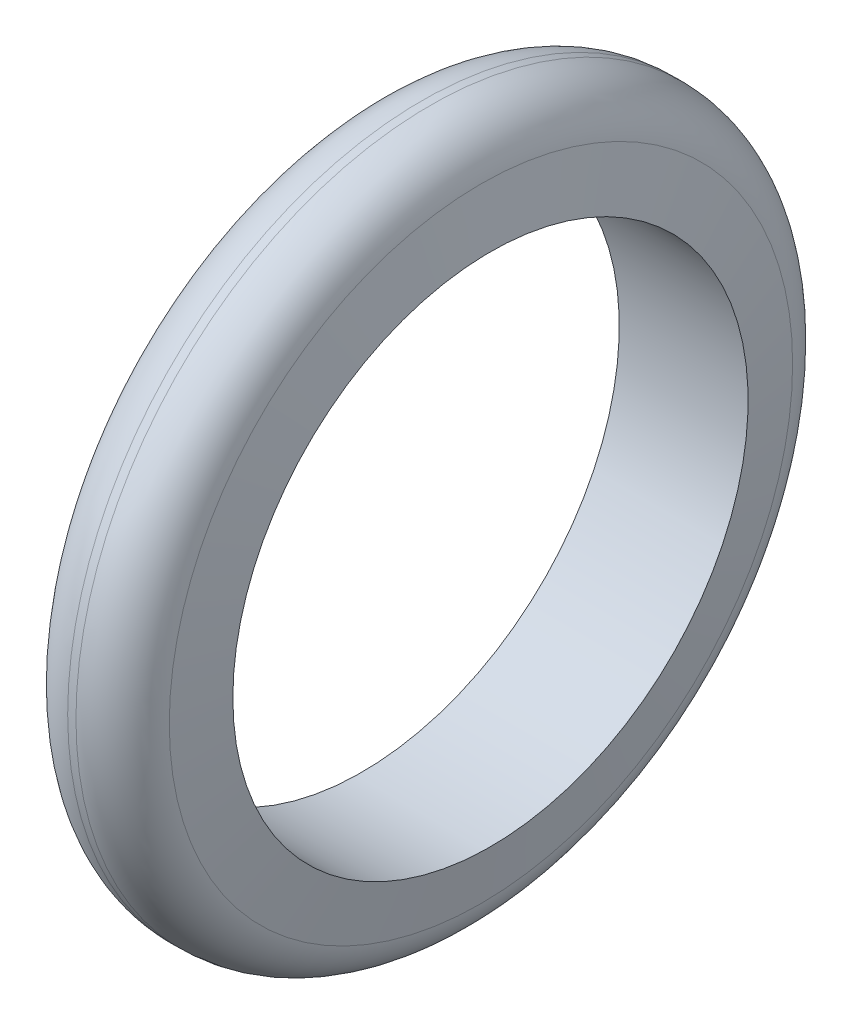
ISO-10303-21;
HEADER;
FILE_DESCRIPTION(('STEP AP214'),'2;1');
FILE_NAME('part.step','',(''),(''),'','','');
FILE_SCHEMA(('AUTOMOTIVE_DESIGN { 1 0 10303 214 1 1 1 1 }'));
ENDSEC;
DATA;
#1=APPLICATION_CONTEXT('core data for automotive mechanical design processes');
#2=APPLICATION_PROTOCOL_DEFINITION('international standard','automotive_design',2000,#1);
#3=PRODUCT_CONTEXT('',#1,'mechanical');
#4=PRODUCT('Part','Part','',(#3));
#5=PRODUCT_RELATED_PRODUCT_CATEGORY('part','',(#4));
#6=PRODUCT_DEFINITION_FORMATION('','',#4);
#7=PRODUCT_DEFINITION_CONTEXT('part definition',#1,'design');
#8=PRODUCT_DEFINITION('design','',#6,#7);
#9=PRODUCT_DEFINITION_SHAPE('','',#8);
#10=(LENGTH_UNIT() NAMED_UNIT(*) SI_UNIT(.MILLI.,.METRE.));
#11=(NAMED_UNIT(*) PLANE_ANGLE_UNIT() SI_UNIT($,.RADIAN.));
#12=(NAMED_UNIT(*) SI_UNIT($,.STERADIAN.) SOLID_ANGLE_UNIT());
#13=UNCERTAINTY_MEASURE_WITH_UNIT(LENGTH_MEASURE(1.E-05),#10,'distance_accuracy_value','');
#14=(GEOMETRIC_REPRESENTATION_CONTEXT(3) GLOBAL_UNCERTAINTY_ASSIGNED_CONTEXT((#13)) GLOBAL_UNIT_ASSIGNED_CONTEXT((#10,
#11,#12)) REPRESENTATION_CONTEXT('',''));
#15=CARTESIAN_POINT('',(0.,0.,0.));
#16=DIRECTION('',(0.,0.,1.));
#17=DIRECTION('',(1.,0.,0.));
#18=AXIS2_PLACEMENT_3D('',#15,#16,#17);
#19=CARTESIAN_POINT('',(-7.35509528937314,0.,0.));
#20=DIRECTION('',(1.,0.,0.));
#21=DIRECTION('',(0.,0.,-1.));
#22=AXIS2_PLACEMENT_3D('',#19,#20,#21);
#23=CONICAL_SURFACE('',#22,55.,1.39626340159547);
#24=CARTESIAN_POINT('',(-8.52076026405252,0.,0.));
#25=DIRECTION('',(-1.,0.,0.));
#26=DIRECTION('',(0.,0.,1.));
#27=AXIS2_PLACEMENT_3D('',#24,#25,#26);
#28=CIRCLE('',#27,48.3891854213354);
#29=CARTESIAN_POINT('',(-8.52076026405252,0.,48.3891854213354));
#30=VERTEX_POINT('',#29);
#31=EDGE_CURVE('E47',#30,#30,#28,.T.);
#32=ORIENTED_EDGE('',*,*,#31,.T.);
#33=EDGE_LOOP('',(#32));
#34=FACE_BOUND('',#33,.T.);
#35=CARTESIAN_POINT('',(-10.,0.,0.));
#36=DIRECTION('',(-1.,0.,0.));
#37=DIRECTION('',(0.,0.,1.));
#38=AXIS2_PLACEMENT_3D('',#35,#36,#37);
#39=CIRCLE('',#38,40.);
#40=CARTESIAN_POINT('',(-10.,0.,40.));
#41=VERTEX_POINT('',#40);
#42=EDGE_CURVE('E52',#41,#41,#39,.T.);
#43=ORIENTED_EDGE('',*,*,#42,.F.);
#44=EDGE_LOOP('',(#43));
#45=FACE_BOUND('',#44,.T.);
#46=ADVANCED_FACE('F32',(#34,#45),#23,.T.);
#47=CARTESIAN_POINT('',(0.,0.,0.));
#48=DIRECTION('',(-1.,0.,0.));
#49=DIRECTION('',(0.,0.,1.));
#50=AXIS2_PLACEMENT_3D('',#47,#48,#49);
#51=CYLINDRICAL_SURFACE('',#50,40.);
#52=CARTESIAN_POINT('',(10.,0.,0.));
#53=DIRECTION('',(-1.,0.,0.));
#54=DIRECTION('',(0.,0.,1.));
#55=AXIS2_PLACEMENT_3D('',#52,#53,#54);
#56=CIRCLE('',#55,40.);
#57=CARTESIAN_POINT('',(10.,0.,40.));
#58=VERTEX_POINT('',#57);
#59=EDGE_CURVE('E55',#58,#58,#56,.T.);
#60=ORIENTED_EDGE('',*,*,#59,.F.);
#61=EDGE_LOOP('',(#60));
#62=FACE_BOUND('',#61,.T.);
#63=ORIENTED_EDGE('',*,*,#42,.T.);
#64=EDGE_LOOP('',(#63));
#65=FACE_BOUND('',#64,.T.);
#66=ADVANCED_FACE('F61',(#62,#65),#51,.F.);
#67=CARTESIAN_POINT('',(10.,0.,0.));
#68=DIRECTION('',(-1.,0.,0.));
#69=DIRECTION('',(0.,0.,1.));
#70=AXIS2_PLACEMENT_3D('',#67,#68,#69);
#71=CONICAL_SURFACE('',#70,40.,1.39626340159547);
#72=CARTESIAN_POINT('',(8.52076026405252,0.,0.));
#73=DIRECTION('',(1.,0.,0.));
#74=DIRECTION('',(0.,0.,-1.));
#75=AXIS2_PLACEMENT_3D('',#72,#73,#74);
#76=CIRCLE('',#75,48.3891854213354);
#77=CARTESIAN_POINT('',(8.52076026405252,0.,-48.3891854213354));
#78=VERTEX_POINT('',#77);
#79=EDGE_CURVE('E10',#78,#78,#76,.T.);
#80=ORIENTED_EDGE('',*,*,#79,.T.);
#81=EDGE_LOOP('',(#80));
#82=FACE_BOUND('',#81,.T.);
#83=ORIENTED_EDGE('',*,*,#59,.T.);
#84=EDGE_LOOP('',(#83));
#85=FACE_BOUND('',#84,.T.);
#86=ADVANCED_FACE('F59',(#82,#85),#71,.T.);
#87=CARTESIAN_POINT('',(0.,0.,0.));
#88=DIRECTION('',(-1.,0.,0.));
#89=DIRECTION('',(0.,0.,1.));
#90=AXIS2_PLACEMENT_3D('',#87,#88,#89);
#91=CYLINDRICAL_SURFACE('',#90,55.);
#92=CARTESIAN_POINT('',(-0.642298239954847,0.,0.));
#93=DIRECTION('',(1.,0.,0.));
#94=DIRECTION('',(0.,0.,-1.));
#95=AXIS2_PLACEMENT_3D('',#92,#93,#94);
#96=CIRCLE('',#95,55.);
#97=CARTESIAN_POINT('',(-0.642298239954847,0.,-55.));
#98=VERTEX_POINT('',#97);
#99=EDGE_CURVE('E39',#98,#98,#96,.T.);
#100=ORIENTED_EDGE('',*,*,#99,.T.);
#101=EDGE_LOOP('',(#100));
#102=FACE_BOUND('',#101,.T.);
#103=CARTESIAN_POINT('',(0.642298239954847,0.,0.));
#104=DIRECTION('',(1.,0.,0.));
#105=DIRECTION('',(0.,0.,-1.));
#106=AXIS2_PLACEMENT_3D('',#103,#104,#105);
#107=CIRCLE('',#106,55.);
#108=CARTESIAN_POINT('',(0.642298239954847,0.,-55.));
#109=VERTEX_POINT('',#108);
#110=EDGE_CURVE('E43',#109,#109,#107,.F.);
#111=ORIENTED_EDGE('',*,*,#110,.T.);
#112=EDGE_LOOP('',(#111));
#113=FACE_BOUND('',#112,.T.);
#114=ADVANCED_FACE('F75',(#102,#113),#91,.T.);
#115=CARTESIAN_POINT('',(-0.642298239954847,0.,0.));
#116=DIRECTION('',(1.,0.,0.));
#117=DIRECTION('',(0.,0.,-1.));
#118=AXIS2_PLACEMENT_3D('',#115,#116,#117);
#119=TOROIDAL_SURFACE('',#118,47.,8.);
#120=ORIENTED_EDGE('',*,*,#99,.F.);
#121=EDGE_LOOP('',(#120));
#122=FACE_BOUND('',#121,.T.);
#123=ORIENTED_EDGE('',*,*,#31,.F.);
#124=EDGE_LOOP('',(#123));
#125=FACE_BOUND('',#124,.T.);
#126=ADVANCED_FACE('F73',(#122,#125),#119,.T.);
#127=CARTESIAN_POINT('',(0.642298239954847,0.,0.));
#128=DIRECTION('',(1.,0.,0.));
#129=DIRECTION('',(0.,0.,-1.));
#130=AXIS2_PLACEMENT_3D('',#127,#128,#129);
#131=TOROIDAL_SURFACE('',#130,47.,8.);
#132=ORIENTED_EDGE('',*,*,#79,.F.);
#133=EDGE_LOOP('',(#132));
#134=FACE_BOUND('',#133,.T.);
#135=ORIENTED_EDGE('',*,*,#110,.F.);
#136=EDGE_LOOP('',(#135));
#137=FACE_BOUND('',#136,.T.);
#138=ADVANCED_FACE('F34',(#134,#137),#131,.T.);
#139=CLOSED_SHELL('',(#46,#66,#86,#114,#126,#138));
#140=MANIFOLD_SOLID_BREP('B2',#139);
#141=ADVANCED_BREP_SHAPE_REPRESENTATION('',(#18,#140),#14);
#142=SHAPE_DEFINITION_REPRESENTATION(#9,#141);
ENDSEC;
END-ISO-10303-21;
